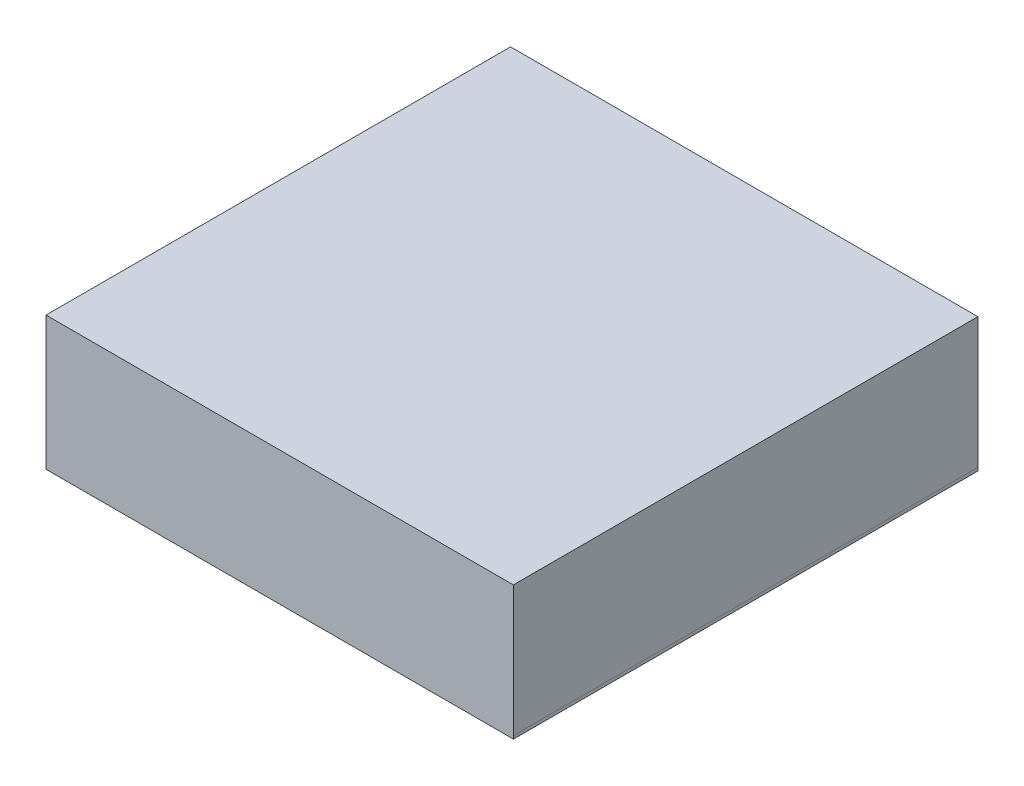
ISO-10303-21;
HEADER;
FILE_DESCRIPTION(('STEP AP214'),'2;1');
FILE_NAME('part.step','',(''),(''),'','','');
FILE_SCHEMA(('AUTOMOTIVE_DESIGN { 1 0 10303 214 1 1 1 1 }'));
ENDSEC;
DATA;
#1=APPLICATION_CONTEXT('core data for automotive mechanical design processes');
#2=APPLICATION_PROTOCOL_DEFINITION('international standard','automotive_design',2000,#1);
#3=PRODUCT_CONTEXT('',#1,'mechanical');
#4=PRODUCT('Part','Part','',(#3));
#5=PRODUCT_RELATED_PRODUCT_CATEGORY('part','',(#4));
#6=PRODUCT_DEFINITION_FORMATION('','',#4);
#7=PRODUCT_DEFINITION_CONTEXT('part definition',#1,'design');
#8=PRODUCT_DEFINITION('design','',#6,#7);
#9=PRODUCT_DEFINITION_SHAPE('','',#8);
#10=(LENGTH_UNIT() NAMED_UNIT(*) SI_UNIT(.MILLI.,.METRE.));
#11=(NAMED_UNIT(*) PLANE_ANGLE_UNIT() SI_UNIT($,.RADIAN.));
#12=(NAMED_UNIT(*) SI_UNIT($,.STERADIAN.) SOLID_ANGLE_UNIT());
#13=UNCERTAINTY_MEASURE_WITH_UNIT(LENGTH_MEASURE(1.E-05),#10,'distance_accuracy_value','');
#14=(GEOMETRIC_REPRESENTATION_CONTEXT(3) GLOBAL_UNCERTAINTY_ASSIGNED_CONTEXT((#13)) GLOBAL_UNIT_ASSIGNED_CONTEXT((#10,
#11,#12)) REPRESENTATION_CONTEXT('',''));
#15=CARTESIAN_POINT('',(0.,0.,0.));
#16=DIRECTION('',(0.,0.,1.));
#17=DIRECTION('',(1.,0.,0.));
#18=AXIS2_PLACEMENT_3D('',#15,#16,#17);
#19=CARTESIAN_POINT('',(-0.40249856,0.11500104,0.80000094));
#20=DIRECTION('',(0.,0.,-1.));
#21=DIRECTION('',(0.,-1.,0.));
#22=AXIS2_PLACEMENT_3D('',#19,#20,#21);
#23=PLANE('',#22);
#24=DIRECTION('',(0.,-1.,0.));
#25=VECTOR('',#24,1.);
#26=CARTESIAN_POINT('',(-0.40249856,0.11500104,0.80000094));
#27=LINE('',#26,#25);
#28=CARTESIAN_POINT('',(-0.40249856,0.11500104,0.80000094));
#29=VERTEX_POINT('',#28);
#30=CARTESIAN_POINT('',(-0.40249856,-0.1149985,0.80000094));
#31=VERTEX_POINT('',#30);
#32=EDGE_CURVE('E98',#29,#31,#27,.T.);
#33=ORIENTED_EDGE('',*,*,#32,.T.);
#34=DIRECTION('',(1.,0.,0.));
#35=VECTOR('',#34,1.);
#36=CARTESIAN_POINT('',(-0.40249856,-0.1149985,0.80000094));
#37=LINE('',#36,#35);
#38=CARTESIAN_POINT('',(0.40249856,-0.1149985,0.80000094));
#39=VERTEX_POINT('',#38);
#40=EDGE_CURVE('E73',#31,#39,#37,.T.);
#41=ORIENTED_EDGE('',*,*,#40,.T.);
#42=DIRECTION('',(-0.0380769102452067,0.999274811503912,0.));
#43=VECTOR('',#42,1.);
#44=CARTESIAN_POINT('',(0.40249856,-0.1149985,0.80000094));
#45=LINE('',#44,#43);
#46=CARTESIAN_POINT('',(0.40230044,-0.10979912,0.80000094));
#47=VERTEX_POINT('',#46);
#48=EDGE_CURVE('E121',#39,#47,#45,.T.);
#49=ORIENTED_EDGE('',*,*,#48,.T.);
#50=DIRECTION('',(0.,1.,0.));
#51=VECTOR('',#50,1.);
#52=CARTESIAN_POINT('',(0.40230044,-0.10979912,0.80000094));
#53=LINE('',#52,#51);
#54=CARTESIAN_POINT('',(0.40230044,0.11500104,0.80000094));
#55=VERTEX_POINT('',#54);
#56=EDGE_CURVE('E92',#47,#55,#53,.T.);
#57=ORIENTED_EDGE('',*,*,#56,.T.);
#58=DIRECTION('',(-1.,0.,0.));
#59=VECTOR('',#58,1.);
#60=CARTESIAN_POINT('',(0.40230044,0.11500104,0.80000094));
#61=LINE('',#60,#59);
#62=EDGE_CURVE('E11',#55,#29,#61,.T.);
#63=ORIENTED_EDGE('',*,*,#62,.T.);
#64=EDGE_LOOP('',(#33,#41,#49,#57,#63));
#65=FACE_BOUND('',#64,.T.);
#66=ADVANCED_FACE('F16',(#65),#23,.F.);
#67=CARTESIAN_POINT('',(-0.40249856,0.11500104,0.));
#68=DIRECTION('',(0.,0.,-1.));
#69=DIRECTION('',(0.,-1.,0.));
#70=AXIS2_PLACEMENT_3D('',#67,#68,#69);
#71=PLANE('',#70);
#72=DIRECTION('',(-1.,0.,0.));
#73=VECTOR('',#72,1.);
#74=CARTESIAN_POINT('',(0.40230044,0.11500104,0.));
#75=LINE('',#74,#73);
#76=CARTESIAN_POINT('',(0.40230044,0.11500104,0.));
#77=VERTEX_POINT('',#76);
#78=CARTESIAN_POINT('',(-0.40249856,0.11500104,0.));
#79=VERTEX_POINT('',#78);
#80=EDGE_CURVE('E27',#77,#79,#75,.T.);
#81=ORIENTED_EDGE('',*,*,#80,.F.);
#82=DIRECTION('',(0.,1.,0.));
#83=VECTOR('',#82,1.);
#84=CARTESIAN_POINT('',(0.40230044,-0.10979912,0.));
#85=LINE('',#84,#83);
#86=CARTESIAN_POINT('',(0.40230044,-0.10979912,0.));
#87=VERTEX_POINT('',#86);
#88=EDGE_CURVE('E127',#87,#77,#85,.T.);
#89=ORIENTED_EDGE('',*,*,#88,.F.);
#90=DIRECTION('',(-0.0380769102452067,0.999274811503912,0.));
#91=VECTOR('',#90,1.);
#92=CARTESIAN_POINT('',(0.40249856,-0.1149985,0.));
#93=LINE('',#92,#91);
#94=CARTESIAN_POINT('',(0.40249856,-0.1149985,0.));
#95=VERTEX_POINT('',#94);
#96=EDGE_CURVE('E108',#95,#87,#93,.T.);
#97=ORIENTED_EDGE('',*,*,#96,.F.);
#98=DIRECTION('',(1.,0.,0.));
#99=VECTOR('',#98,1.);
#100=CARTESIAN_POINT('',(-0.40249856,-0.1149985,0.));
#101=LINE('',#100,#99);
#102=CARTESIAN_POINT('',(-0.40249856,-0.1149985,0.));
#103=VERTEX_POINT('',#102);
#104=EDGE_CURVE('E81',#103,#95,#101,.T.);
#105=ORIENTED_EDGE('',*,*,#104,.F.);
#106=DIRECTION('',(0.,-1.,0.));
#107=VECTOR('',#106,1.);
#108=CARTESIAN_POINT('',(-0.40249856,0.11500104,0.));
#109=LINE('',#108,#107);
#110=EDGE_CURVE('E97',#79,#103,#109,.T.);
#111=ORIENTED_EDGE('',*,*,#110,.F.);
#112=EDGE_LOOP('',(#81,#89,#97,#105,#111));
#113=FACE_BOUND('',#112,.T.);
#114=ADVANCED_FACE('F101',(#113),#71,.T.);
#115=CARTESIAN_POINT('',(0.40230044,0.11500104,0.));
#116=DIRECTION('',(0.,-1.,0.));
#117=DIRECTION('',(0.,0.,-1.));
#118=AXIS2_PLACEMENT_3D('',#115,#116,#117);
#119=PLANE('',#118);
#120=ORIENTED_EDGE('',*,*,#80,.T.);
#121=DIRECTION('',(0.,0.,1.));
#122=VECTOR('',#121,1.);
#123=CARTESIAN_POINT('',(-0.40249856,0.11500104,0.));
#124=LINE('',#123,#122);
#125=EDGE_CURVE('E87',#79,#29,#124,.T.);
#126=ORIENTED_EDGE('',*,*,#125,.T.);
#127=ORIENTED_EDGE('',*,*,#62,.F.);
#128=DIRECTION('',(0.,0.,1.));
#129=VECTOR('',#128,1.);
#130=CARTESIAN_POINT('',(0.40230044,0.11500104,0.));
#131=LINE('',#130,#129);
#132=EDGE_CURVE('E20',#77,#55,#131,.T.);
#133=ORIENTED_EDGE('',*,*,#132,.F.);
#134=EDGE_LOOP('',(#120,#126,#127,#133));
#135=FACE_BOUND('',#134,.T.);
#136=ADVANCED_FACE('F86',(#135),#119,.F.);
#137=CARTESIAN_POINT('',(0.40230044,-0.10979912,0.));
#138=DIRECTION('',(-1.,0.,0.));
#139=DIRECTION('',(0.,0.,1.));
#140=AXIS2_PLACEMENT_3D('',#137,#138,#139);
#141=PLANE('',#140);
#142=ORIENTED_EDGE('',*,*,#88,.T.);
#143=ORIENTED_EDGE('',*,*,#132,.T.);
#144=ORIENTED_EDGE('',*,*,#56,.F.);
#145=DIRECTION('',(0.,0.,1.));
#146=VECTOR('',#145,1.);
#147=CARTESIAN_POINT('',(0.40230044,-0.10979912,0.));
#148=LINE('',#147,#146);
#149=EDGE_CURVE('E112',#87,#47,#148,.T.);
#150=ORIENTED_EDGE('',*,*,#149,.F.);
#151=EDGE_LOOP('',(#142,#143,#144,#150));
#152=FACE_BOUND('',#151,.T.);
#153=ADVANCED_FACE('F146',(#152),#141,.F.);
#154=CARTESIAN_POINT('',(0.40249856,-0.1149985,0.));
#155=DIRECTION('',(-0.999274811503912,-0.0380769102452067,0.));
#156=DIRECTION('',(-0.0380769102452067,0.999274811503912,0.));
#157=AXIS2_PLACEMENT_3D('',#154,#155,#156);
#158=PLANE('',#157);
#159=ORIENTED_EDGE('',*,*,#96,.T.);
#160=ORIENTED_EDGE('',*,*,#149,.T.);
#161=ORIENTED_EDGE('',*,*,#48,.F.);
#162=DIRECTION('',(0.,0.,1.));
#163=VECTOR('',#162,1.);
#164=CARTESIAN_POINT('',(0.40249856,-0.1149985,0.));
#165=LINE('',#164,#163);
#166=EDGE_CURVE('E113',#95,#39,#165,.T.);
#167=ORIENTED_EDGE('',*,*,#166,.F.);
#168=EDGE_LOOP('',(#159,#160,#161,#167));
#169=FACE_BOUND('',#168,.T.);
#170=ADVANCED_FACE('F145',(#169),#158,.F.);
#171=CARTESIAN_POINT('',(-0.40249856,-0.1149985,0.));
#172=DIRECTION('',(0.,1.,0.));
#173=DIRECTION('',(1.,0.,0.));
#174=AXIS2_PLACEMENT_3D('',#171,#172,#173);
#175=PLANE('',#174);
#176=ORIENTED_EDGE('',*,*,#104,.T.);
#177=ORIENTED_EDGE('',*,*,#166,.T.);
#178=ORIENTED_EDGE('',*,*,#40,.F.);
#179=DIRECTION('',(0.,0.,1.));
#180=VECTOR('',#179,1.);
#181=CARTESIAN_POINT('',(-0.40249856,-0.1149985,0.));
#182=LINE('',#181,#180);
#183=EDGE_CURVE('E103',#103,#31,#182,.T.);
#184=ORIENTED_EDGE('',*,*,#183,.F.);
#185=EDGE_LOOP('',(#176,#177,#178,#184));
#186=FACE_BOUND('',#185,.T.);
#187=ADVANCED_FACE('F142',(#186),#175,.F.);
#188=CARTESIAN_POINT('',(-0.40249856,0.11500104,0.));
#189=DIRECTION('',(1.,0.,0.));
#190=DIRECTION('',(0.,1.,0.));
#191=AXIS2_PLACEMENT_3D('',#188,#189,#190);
#192=PLANE('',#191);
#193=ORIENTED_EDGE('',*,*,#110,.T.);
#194=ORIENTED_EDGE('',*,*,#183,.T.);
#195=ORIENTED_EDGE('',*,*,#32,.F.);
#196=ORIENTED_EDGE('',*,*,#125,.F.);
#197=EDGE_LOOP('',(#193,#194,#195,#196));
#198=FACE_BOUND('',#197,.T.);
#199=ADVANCED_FACE('F18',(#198),#192,.F.);
#200=CLOSED_SHELL('',(#66,#114,#136,#153,#170,#187,#199));
#201=MANIFOLD_SOLID_BREP('B1',#200);
#202=ADVANCED_BREP_SHAPE_REPRESENTATION('',(#18,#201),#14);
#203=SHAPE_DEFINITION_REPRESENTATION(#9,#202);
ENDSEC;
END-ISO-10303-21;
